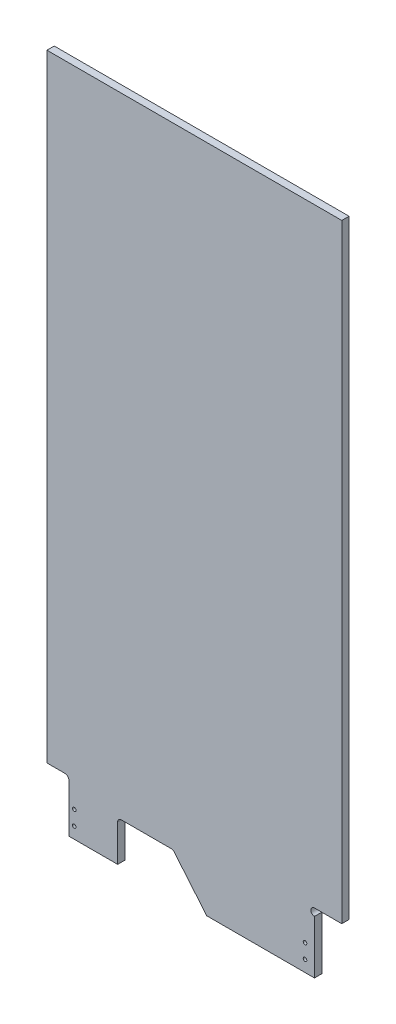
ISO-10303-21;
HEADER;
FILE_DESCRIPTION(('STEP AP214'),'2;1');
FILE_NAME('part.step','',(''),(''),'','','');
FILE_SCHEMA(('AUTOMOTIVE_DESIGN { 1 0 10303 214 1 1 1 1 }'));
ENDSEC;
DATA;
#1=APPLICATION_CONTEXT('core data for automotive mechanical design processes');
#2=APPLICATION_PROTOCOL_DEFINITION('international standard','automotive_design',2000,#1);
#3=PRODUCT_CONTEXT('',#1,'mechanical');
#4=PRODUCT('Part','Part','',(#3));
#5=PRODUCT_RELATED_PRODUCT_CATEGORY('part','',(#4));
#6=PRODUCT_DEFINITION_FORMATION('','',#4);
#7=PRODUCT_DEFINITION_CONTEXT('part definition',#1,'design');
#8=PRODUCT_DEFINITION('design','',#6,#7);
#9=PRODUCT_DEFINITION_SHAPE('','',#8);
#10=(LENGTH_UNIT() NAMED_UNIT(*) SI_UNIT(.MILLI.,.METRE.));
#11=(NAMED_UNIT(*) PLANE_ANGLE_UNIT() SI_UNIT($,.RADIAN.));
#12=(NAMED_UNIT(*) SI_UNIT($,.STERADIAN.) SOLID_ANGLE_UNIT());
#13=UNCERTAINTY_MEASURE_WITH_UNIT(LENGTH_MEASURE(1.E-05),#10,'distance_accuracy_value','');
#14=(GEOMETRIC_REPRESENTATION_CONTEXT(3) GLOBAL_UNCERTAINTY_ASSIGNED_CONTEXT((#13)) GLOBAL_UNIT_ASSIGNED_CONTEXT((#10,
#11,#12)) REPRESENTATION_CONTEXT('',''));
#15=CARTESIAN_POINT('',(0.,0.,0.));
#16=DIRECTION('',(0.,0.,1.));
#17=DIRECTION('',(1.,0.,0.));
#18=AXIS2_PLACEMENT_3D('',#15,#16,#17);
#19=CARTESIAN_POINT('',(10375.9021420887,13102.653009206,-12.7));
#20=DIRECTION('',(-1.,0.,0.));
#21=DIRECTION('',(0.,0.,1.));
#22=AXIS2_PLACEMENT_3D('',#19,#20,#21);
#23=PLANE('',#22);
#24=DIRECTION('',(0.,-1.,0.));
#25=VECTOR('',#24,1.);
#26=CARTESIAN_POINT('',(10375.9021420887,13102.653009206,0.));
#27=LINE('',#26,#25);
#28=CARTESIAN_POINT('',(10375.9021420887,13102.653009206,0.));
#29=VERTEX_POINT('',#28);
#30=CARTESIAN_POINT('',(10375.9021420887,13017.5001101928,0.));
#31=VERTEX_POINT('',#30);
#32=EDGE_CURVE('E176',#29,#31,#27,.T.);
#33=ORIENTED_EDGE('',*,*,#32,.F.);
#34=DIRECTION('',(0.,0.,1.));
#35=VECTOR('',#34,1.);
#36=CARTESIAN_POINT('',(10375.9021420887,13102.653009206,-12.7));
#37=LINE('',#36,#35);
#38=CARTESIAN_POINT('',(10375.9021420887,13102.653009206,-12.7));
#39=VERTEX_POINT('',#38);
#40=EDGE_CURVE('E11',#39,#29,#37,.T.);
#41=ORIENTED_EDGE('',*,*,#40,.F.);
#42=DIRECTION('',(0.,-1.,0.));
#43=VECTOR('',#42,1.);
#44=CARTESIAN_POINT('',(10375.9021420887,13102.653009206,-12.7));
#45=LINE('',#44,#43);
#46=CARTESIAN_POINT('',(10375.9021420887,13017.5001101928,-12.7));
#47=VERTEX_POINT('',#46);
#48=EDGE_CURVE('E221',#39,#47,#45,.T.);
#49=ORIENTED_EDGE('',*,*,#48,.T.);
#50=DIRECTION('',(0.,0.,1.));
#51=VECTOR('',#50,1.);
#52=CARTESIAN_POINT('',(10375.9021420887,13017.5001101928,-12.7));
#53=LINE('',#52,#51);
#54=EDGE_CURVE('E34',#47,#31,#53,.T.);
#55=ORIENTED_EDGE('',*,*,#54,.T.);
#56=EDGE_LOOP('',(#33,#41,#49,#55));
#57=FACE_BOUND('',#56,.T.);
#58=ADVANCED_FACE('F31',(#57),#23,.T.);
#59=CARTESIAN_POINT('',(10369.5521420887,13102.653009206,-12.7));
#60=DIRECTION('',(0.,0.,1.));
#61=DIRECTION('',(1.,0.,0.));
#62=AXIS2_PLACEMENT_3D('',#59,#60,#61);
#63=CYLINDRICAL_SURFACE('',#62,6.34999999999941);
#64=CARTESIAN_POINT('',(10369.5521420887,13102.653009206,0.));
#65=DIRECTION('',(0.,0.,-1.));
#66=DIRECTION('',(-1.,0.,0.));
#67=AXIS2_PLACEMENT_3D('',#64,#65,#66);
#68=CIRCLE('',#67,6.34999999999941);
#69=CARTESIAN_POINT('',(10369.5521420887,13109.003009206,0.));
#70=VERTEX_POINT('',#69);
#71=EDGE_CURVE('E219',#70,#29,#68,.T.);
#72=ORIENTED_EDGE('',*,*,#71,.F.);
#73=DIRECTION('',(0.,0.,1.));
#74=VECTOR('',#73,1.);
#75=CARTESIAN_POINT('',(10369.5521420887,13109.003009206,-12.7));
#76=LINE('',#75,#74);
#77=CARTESIAN_POINT('',(10369.5521420887,13109.003009206,-12.7));
#78=VERTEX_POINT('',#77);
#79=EDGE_CURVE('E40',#78,#70,#76,.T.);
#80=ORIENTED_EDGE('',*,*,#79,.F.);
#81=CARTESIAN_POINT('',(10369.5521420887,13102.653009206,-12.7));
#82=DIRECTION('',(0.,0.,-1.));
#83=DIRECTION('',(-1.,0.,0.));
#84=AXIS2_PLACEMENT_3D('',#81,#82,#83);
#85=CIRCLE('',#84,6.34999999999941);
#86=EDGE_CURVE('E166',#78,#39,#85,.T.);
#87=ORIENTED_EDGE('',*,*,#86,.T.);
#88=ORIENTED_EDGE('',*,*,#40,.T.);
#89=EDGE_LOOP('',(#72,#80,#87,#88));
#90=FACE_BOUND('',#89,.T.);
#91=ADVANCED_FACE('F249',(#90),#63,.F.);
#92=CARTESIAN_POINT('',(10337.8021420887,13109.003009206,-12.7));
#93=DIRECTION('',(0.,-1.,0.));
#94=DIRECTION('',(0.,0.,-1.));
#95=AXIS2_PLACEMENT_3D('',#92,#93,#94);
#96=PLANE('',#95);
#97=DIRECTION('',(1.,0.,0.));
#98=VECTOR('',#97,1.);
#99=CARTESIAN_POINT('',(10337.8021420887,13109.003009206,0.));
#100=LINE('',#99,#98);
#101=CARTESIAN_POINT('',(10337.8021420887,13109.003009206,0.));
#102=VERTEX_POINT('',#101);
#103=EDGE_CURVE('E153',#102,#70,#100,.T.);
#104=ORIENTED_EDGE('',*,*,#103,.F.);
#105=DIRECTION('',(0.,0.,1.));
#106=VECTOR('',#105,1.);
#107=CARTESIAN_POINT('',(10337.8021420887,13109.003009206,-12.7));
#108=LINE('',#107,#106);
#109=CARTESIAN_POINT('',(10337.8021420887,13109.003009206,-12.7));
#110=VERTEX_POINT('',#109);
#111=EDGE_CURVE('E148',#110,#102,#108,.T.);
#112=ORIENTED_EDGE('',*,*,#111,.F.);
#113=DIRECTION('',(1.,0.,0.));
#114=VECTOR('',#113,1.);
#115=CARTESIAN_POINT('',(10337.8021420887,13109.003009206,-12.7));
#116=LINE('',#115,#114);
#117=EDGE_CURVE('E151',#110,#78,#116,.T.);
#118=ORIENTED_EDGE('',*,*,#117,.T.);
#119=ORIENTED_EDGE('',*,*,#79,.T.);
#120=EDGE_LOOP('',(#104,#112,#118,#119));
#121=FACE_BOUND('',#120,.T.);
#122=ADVANCED_FACE('F150',(#121),#96,.T.);
#123=CARTESIAN_POINT('',(10337.8007478141,14185.9001101928,-12.7));
#124=DIRECTION('',(-0.999999999999162,-1.29471476797222E-06,0.));
#125=DIRECTION('',(1.29471476797222E-06,-0.999999999999162,0.));
#126=AXIS2_PLACEMENT_3D('',#123,#124,#125);
#127=PLANE('',#126);
#128=DIRECTION('',(1.29471476797222E-06,-0.999999999999162,0.));
#129=VECTOR('',#128,1.);
#130=CARTESIAN_POINT('',(10337.8007478141,14185.9001101928,0.));
#131=LINE('',#130,#129);
#132=CARTESIAN_POINT('',(10337.8007478141,14185.9001101928,0.));
#133=VERTEX_POINT('',#132);
#134=EDGE_CURVE('E216',#133,#102,#131,.T.);
#135=ORIENTED_EDGE('',*,*,#134,.F.);
#136=DIRECTION('',(0.,0.,1.));
#137=VECTOR('',#136,1.);
#138=CARTESIAN_POINT('',(10337.8007478141,14185.9001101928,-12.7));
#139=LINE('',#138,#137);
#140=CARTESIAN_POINT('',(10337.8007478141,14185.9001101928,-12.7));
#141=VERTEX_POINT('',#140);
#142=EDGE_CURVE('E158',#141,#133,#139,.T.);
#143=ORIENTED_EDGE('',*,*,#142,.F.);
#144=DIRECTION('',(1.29471476797222E-06,-0.999999999999162,0.));
#145=VECTOR('',#144,1.);
#146=CARTESIAN_POINT('',(10337.8007478141,14185.9001101928,-12.7));
#147=LINE('',#146,#145);
#148=EDGE_CURVE('E164',#141,#110,#147,.T.);
#149=ORIENTED_EDGE('',*,*,#148,.T.);
#150=ORIENTED_EDGE('',*,*,#111,.T.);
#151=EDGE_LOOP('',(#135,#143,#149,#150));
#152=FACE_BOUND('',#151,.T.);
#153=ADVANCED_FACE('F168',(#152),#127,.T.);
#154=CARTESIAN_POINT('',(10852.1479242815,14185.9001101928,-12.7));
#155=DIRECTION('',(0.,1.,0.));
#156=DIRECTION('',(0.,0.,1.));
#157=AXIS2_PLACEMENT_3D('',#154,#155,#156);
#158=PLANE('',#157);
#159=DIRECTION('',(-1.,0.,0.));
#160=VECTOR('',#159,1.);
#161=CARTESIAN_POINT('',(10852.1479242815,14185.9001101928,0.));
#162=LINE('',#161,#160);
#163=CARTESIAN_POINT('',(10852.1479242815,14185.9001101928,0.));
#164=VERTEX_POINT('',#163);
#165=EDGE_CURVE('E213',#164,#133,#162,.T.);
#166=ORIENTED_EDGE('',*,*,#165,.F.);
#167=DIRECTION('',(0.,0.,1.));
#168=VECTOR('',#167,1.);
#169=CARTESIAN_POINT('',(10852.1479242815,14185.9001101928,-12.7));
#170=LINE('',#169,#168);
#171=CARTESIAN_POINT('',(10852.1479242815,14185.9001101928,-12.7));
#172=VERTEX_POINT('',#171);
#173=EDGE_CURVE('E225',#172,#164,#170,.T.);
#174=ORIENTED_EDGE('',*,*,#173,.F.);
#175=DIRECTION('',(-1.,0.,0.));
#176=VECTOR('',#175,1.);
#177=CARTESIAN_POINT('',(10852.1479242815,14185.9001101928,-12.7));
#178=LINE('',#177,#176);
#179=EDGE_CURVE('E169',#172,#141,#178,.T.);
#180=ORIENTED_EDGE('',*,*,#179,.T.);
#181=ORIENTED_EDGE('',*,*,#142,.T.);
#182=EDGE_LOOP('',(#166,#174,#180,#181));
#183=FACE_BOUND('',#182,.T.);
#184=ADVANCED_FACE('F262',(#183),#158,.T.);
#185=CARTESIAN_POINT('',(10852.1507478141,13123.290509206,-12.7));
#186=DIRECTION('',(0.99999999999647,2.65716833036978E-06,0.));
#187=DIRECTION('',(-2.65716833036978E-06,0.99999999999647,0.));
#188=AXIS2_PLACEMENT_3D('',#185,#186,#187);
#189=PLANE('',#188);
#190=DIRECTION('',(-2.65716833036978E-06,0.99999999999647,0.));
#191=VECTOR('',#190,1.);
#192=CARTESIAN_POINT('',(10852.1507478141,13123.290509206,0.));
#193=LINE('',#192,#191);
#194=CARTESIAN_POINT('',(10852.1507478141,13123.290509206,0.));
#195=VERTEX_POINT('',#194);
#196=EDGE_CURVE('E210',#195,#164,#193,.T.);
#197=ORIENTED_EDGE('',*,*,#196,.F.);
#198=DIRECTION('',(0.,0.,1.));
#199=VECTOR('',#198,1.);
#200=CARTESIAN_POINT('',(10852.1507478141,13123.290509206,-12.7));
#201=LINE('',#200,#199);
#202=CARTESIAN_POINT('',(10852.1507478141,13123.290509206,-12.7));
#203=VERTEX_POINT('',#202);
#204=EDGE_CURVE('E227',#203,#195,#201,.T.);
#205=ORIENTED_EDGE('',*,*,#204,.F.);
#206=DIRECTION('',(-2.65716833036978E-06,0.99999999999647,0.));
#207=VECTOR('',#206,1.);
#208=CARTESIAN_POINT('',(10852.1507478141,13123.290509206,-12.7));
#209=LINE('',#208,#207);
#210=EDGE_CURVE('E171',#203,#172,#209,.T.);
#211=ORIENTED_EDGE('',*,*,#210,.T.);
#212=ORIENTED_EDGE('',*,*,#173,.T.);
#213=EDGE_LOOP('',(#197,#205,#211,#212));
#214=FACE_BOUND('',#213,.T.);
#215=ADVANCED_FACE('F265',(#214),#189,.T.);
#216=CARTESIAN_POINT('',(10804.5257478141,13123.290509206,-12.7));
#217=DIRECTION('',(0.,-1.,0.));
#218=DIRECTION('',(0.,0.,-1.));
#219=AXIS2_PLACEMENT_3D('',#216,#217,#218);
#220=PLANE('',#219);
#221=DIRECTION('',(1.,0.,0.));
#222=VECTOR('',#221,1.);
#223=CARTESIAN_POINT('',(10804.5257478141,13123.290509206,0.));
#224=LINE('',#223,#222);
#225=CARTESIAN_POINT('',(10804.5257478141,13123.290509206,0.));
#226=VERTEX_POINT('',#225);
#227=EDGE_CURVE('E207',#226,#195,#224,.T.);
#228=ORIENTED_EDGE('',*,*,#227,.F.);
#229=DIRECTION('',(0.,0.,1.));
#230=VECTOR('',#229,1.);
#231=CARTESIAN_POINT('',(10804.5257478141,13123.290509206,-12.7));
#232=LINE('',#231,#230);
#233=CARTESIAN_POINT('',(10804.5257478141,13123.290509206,-12.7));
#234=VERTEX_POINT('',#233);
#235=EDGE_CURVE('E229',#234,#226,#232,.T.);
#236=ORIENTED_EDGE('',*,*,#235,.F.);
#237=DIRECTION('',(1.,0.,0.));
#238=VECTOR('',#237,1.);
#239=CARTESIAN_POINT('',(10804.5257478141,13123.290509206,-12.7));
#240=LINE('',#239,#238);
#241=EDGE_CURVE('E387',#234,#203,#240,.T.);
#242=ORIENTED_EDGE('',*,*,#241,.T.);
#243=ORIENTED_EDGE('',*,*,#204,.T.);
#244=EDGE_LOOP('',(#228,#236,#242,#243));
#245=FACE_BOUND('',#244,.T.);
#246=ADVANCED_FACE('F269',(#245),#220,.T.);
#247=CARTESIAN_POINT('',(10804.5257478141,13116.940509206,-12.7));
#248=DIRECTION('',(0.,0.,1.));
#249=DIRECTION('',(1.,0.,0.));
#250=AXIS2_PLACEMENT_3D('',#247,#248,#249);
#251=CYLINDRICAL_SURFACE('',#250,6.34999999999941);
#252=CARTESIAN_POINT('',(10804.5257478141,13116.940509206,0.));
#253=DIRECTION('',(0.,0.,-1.));
#254=DIRECTION('',(1.,0.,0.));
#255=AXIS2_PLACEMENT_3D('',#252,#253,#254);
#256=CIRCLE('',#255,6.34999999999941);
#257=CARTESIAN_POINT('',(10804.5257478141,13110.590509206,0.));
#258=VERTEX_POINT('',#257);
#259=EDGE_CURVE('E204',#258,#226,#256,.T.);
#260=ORIENTED_EDGE('',*,*,#259,.F.);
#261=DIRECTION('',(0.,0.,1.));
#262=VECTOR('',#261,1.);
#263=CARTESIAN_POINT('',(10804.5257478141,13110.590509206,-12.7));
#264=LINE('',#263,#262);
#265=CARTESIAN_POINT('',(10804.5257478141,13110.590509206,-12.7));
#266=VERTEX_POINT('',#265);
#267=EDGE_CURVE('E231',#266,#258,#264,.T.);
#268=ORIENTED_EDGE('',*,*,#267,.F.);
#269=CARTESIAN_POINT('',(10804.5257478141,13116.940509206,-12.7));
#270=DIRECTION('',(0.,0.,-1.));
#271=DIRECTION('',(1.,0.,0.));
#272=AXIS2_PLACEMENT_3D('',#269,#270,#271);
#273=CIRCLE('',#272,6.34999999999941);
#274=EDGE_CURVE('E384',#266,#234,#273,.T.);
#275=ORIENTED_EDGE('',*,*,#274,.T.);
#276=ORIENTED_EDGE('',*,*,#235,.T.);
#277=EDGE_LOOP('',(#260,#268,#275,#276));
#278=FACE_BOUND('',#277,.T.);
#279=ADVANCED_FACE('F273',(#278),#251,.F.);
#280=CARTESIAN_POINT('',(10804.5257478141,13017.5001101928,-12.7));
#281=DIRECTION('',(1.,0.,0.));
#282=DIRECTION('',(0.,0.,-1.));
#283=AXIS2_PLACEMENT_3D('',#280,#281,#282);
#284=PLANE('',#283);
#285=DIRECTION('',(0.,1.,0.));
#286=VECTOR('',#285,1.);
#287=CARTESIAN_POINT('',(10804.5257478141,13017.5001101928,0.));
#288=LINE('',#287,#286);
#289=CARTESIAN_POINT('',(10804.5257478141,13017.5001101928,0.));
#290=VERTEX_POINT('',#289);
#291=EDGE_CURVE('E201',#290,#258,#288,.T.);
#292=ORIENTED_EDGE('',*,*,#291,.F.);
#293=DIRECTION('',(0.,0.,1.));
#294=VECTOR('',#293,1.);
#295=CARTESIAN_POINT('',(10804.5257478141,13017.5001101928,-12.7));
#296=LINE('',#295,#294);
#297=CARTESIAN_POINT('',(10804.5257478141,13017.5001101928,-12.7));
#298=VERTEX_POINT('',#297);
#299=EDGE_CURVE('E233',#298,#290,#296,.T.);
#300=ORIENTED_EDGE('',*,*,#299,.F.);
#301=DIRECTION('',(0.,1.,0.));
#302=VECTOR('',#301,1.);
#303=CARTESIAN_POINT('',(10804.5257478141,13017.5001101928,-12.7));
#304=LINE('',#303,#302);
#305=EDGE_CURVE('E381',#298,#266,#304,.T.);
#306=ORIENTED_EDGE('',*,*,#305,.T.);
#307=ORIENTED_EDGE('',*,*,#267,.T.);
#308=EDGE_LOOP('',(#292,#300,#306,#307));
#309=FACE_BOUND('',#308,.T.);
#310=ADVANCED_FACE('F277',(#309),#284,.T.);
#311=CARTESIAN_POINT('',(10616.6252235168,13017.5001101928,-12.7));
#312=DIRECTION('',(0.,-1.,0.));
#313=DIRECTION('',(0.,0.,-1.));
#314=AXIS2_PLACEMENT_3D('',#311,#312,#313);
#315=PLANE('',#314);
#316=DIRECTION('',(1.,0.,0.));
#317=VECTOR('',#316,1.);
#318=CARTESIAN_POINT('',(10616.6252235168,13017.5001101928,0.));
#319=LINE('',#318,#317);
#320=CARTESIAN_POINT('',(10616.6252235168,13017.5001101928,0.));
#321=VERTEX_POINT('',#320);
#322=EDGE_CURVE('E198',#321,#290,#319,.T.);
#323=ORIENTED_EDGE('',*,*,#322,.F.);
#324=DIRECTION('',(0.,0.,1.));
#325=VECTOR('',#324,1.);
#326=CARTESIAN_POINT('',(10616.6252235168,13017.5001101928,-12.7));
#327=LINE('',#326,#325);
#328=CARTESIAN_POINT('',(10616.6252235168,13017.5001101928,-12.7));
#329=VERTEX_POINT('',#328);
#330=EDGE_CURVE('E235',#329,#321,#327,.T.);
#331=ORIENTED_EDGE('',*,*,#330,.F.);
#332=DIRECTION('',(1.,0.,0.));
#333=VECTOR('',#332,1.);
#334=CARTESIAN_POINT('',(10616.6252235168,13017.5001101928,-12.7));
#335=LINE('',#334,#333);
#336=EDGE_CURVE('E378',#329,#298,#335,.T.);
#337=ORIENTED_EDGE('',*,*,#336,.T.);
#338=ORIENTED_EDGE('',*,*,#299,.T.);
#339=EDGE_LOOP('',(#323,#331,#337,#338));
#340=FACE_BOUND('',#339,.T.);
#341=ADVANCED_FACE('F281',(#340),#315,.T.);
#342=CARTESIAN_POINT('',(10559.6498937161,13085.6670433405,-12.7));
#343=DIRECTION('',(-0.767281863842619,-0.641310019739437,0.));
#344=DIRECTION('',(0.641310019739437,-0.767281863842619,0.));
#345=AXIS2_PLACEMENT_3D('',#342,#343,#344);
#346=PLANE('',#345);
#347=DIRECTION('',(0.641310019739437,-0.767281863842619,0.));
#348=VECTOR('',#347,1.);
#349=CARTESIAN_POINT('',(10559.6498937161,13085.6670433405,0.));
#350=LINE('',#349,#348);
#351=CARTESIAN_POINT('',(10559.6498937161,13085.6670433405,0.));
#352=VERTEX_POINT('',#351);
#353=EDGE_CURVE('E195',#352,#321,#350,.T.);
#354=ORIENTED_EDGE('',*,*,#353,.F.);
#355=DIRECTION('',(0.,0.,1.));
#356=VECTOR('',#355,1.);
#357=CARTESIAN_POINT('',(10559.6498937161,13085.6670433405,-12.7));
#358=LINE('',#357,#356);
#359=CARTESIAN_POINT('',(10559.6498937161,13085.6670433405,-12.7));
#360=VERTEX_POINT('',#359);
#361=EDGE_CURVE('E237',#360,#352,#358,.T.);
#362=ORIENTED_EDGE('',*,*,#361,.F.);
#363=DIRECTION('',(0.641310019739437,-0.767281863842619,0.));
#364=VECTOR('',#363,1.);
#365=CARTESIAN_POINT('',(10559.6498937161,13085.6670433405,-12.7));
#366=LINE('',#365,#364);
#367=EDGE_CURVE('E375',#360,#329,#366,.T.);
#368=ORIENTED_EDGE('',*,*,#367,.T.);
#369=ORIENTED_EDGE('',*,*,#330,.T.);
#370=EDGE_LOOP('',(#354,#362,#368,#369));
#371=FACE_BOUND('',#370,.T.);
#372=ADVANCED_FACE('F285',(#371),#346,.T.);
#373=CARTESIAN_POINT('',(10554.7776538797,13081.5947247155,-12.7));
#374=DIRECTION('',(0.,0.,1.));
#375=DIRECTION('',(1.,0.,0.));
#376=AXIS2_PLACEMENT_3D('',#373,#374,#375);
#377=CYLINDRICAL_SURFACE('',#376,6.3500000005553);
#378=CARTESIAN_POINT('',(10554.7776538797,13081.5947247155,0.));
#379=DIRECTION('',(0.,0.,-1.));
#380=DIRECTION('',(-1.,0.,0.));
#381=AXIS2_PLACEMENT_3D('',#378,#379,#380);
#382=CIRCLE('',#381,6.3500000005553);
#383=CARTESIAN_POINT('',(10554.7776538797,13087.9447247161,0.));
#384=VERTEX_POINT('',#383);
#385=EDGE_CURVE('E192',#384,#352,#382,.T.);
#386=ORIENTED_EDGE('',*,*,#385,.F.);
#387=DIRECTION('',(0.,0.,1.));
#388=VECTOR('',#387,1.);
#389=CARTESIAN_POINT('',(10554.7776538797,13087.9447247161,-12.7));
#390=LINE('',#389,#388);
#391=CARTESIAN_POINT('',(10554.7776538797,13087.9447247161,-12.7));
#392=VERTEX_POINT('',#391);
#393=EDGE_CURVE('E239',#392,#384,#390,.T.);
#394=ORIENTED_EDGE('',*,*,#393,.F.);
#395=CARTESIAN_POINT('',(10554.7776538797,13081.5947247155,-12.7));
#396=DIRECTION('',(0.,0.,-1.));
#397=DIRECTION('',(-1.,0.,0.));
#398=AXIS2_PLACEMENT_3D('',#395,#396,#397);
#399=CIRCLE('',#398,6.3500000005553);
#400=EDGE_CURVE('E372',#392,#360,#399,.T.);
#401=ORIENTED_EDGE('',*,*,#400,.T.);
#402=ORIENTED_EDGE('',*,*,#361,.T.);
#403=EDGE_LOOP('',(#386,#394,#401,#402));
#404=FACE_BOUND('',#403,.T.);
#405=ADVANCED_FACE('F289',(#404),#377,.F.);
#406=CARTESIAN_POINT('',(10467.5527820586,13087.9447247161,-12.7));
#407=DIRECTION('',(0.,-1.,0.));
#408=DIRECTION('',(0.,0.,-1.));
#409=AXIS2_PLACEMENT_3D('',#406,#407,#408);
#410=PLANE('',#409);
#411=DIRECTION('',(1.,0.,0.));
#412=VECTOR('',#411,1.);
#413=CARTESIAN_POINT('',(10467.5527820586,13087.9447247161,0.));
#414=LINE('',#413,#412);
#415=CARTESIAN_POINT('',(10467.5527820586,13087.9447247161,0.));
#416=VERTEX_POINT('',#415);
#417=EDGE_CURVE('E189',#416,#384,#414,.T.);
#418=ORIENTED_EDGE('',*,*,#417,.F.);
#419=DIRECTION('',(0.,0.,1.));
#420=VECTOR('',#419,1.);
#421=CARTESIAN_POINT('',(10467.5527820586,13087.9447247161,-12.7));
#422=LINE('',#421,#420);
#423=CARTESIAN_POINT('',(10467.5527820586,13087.9447247161,-12.7));
#424=VERTEX_POINT('',#423);
#425=EDGE_CURVE('E241',#424,#416,#422,.T.);
#426=ORIENTED_EDGE('',*,*,#425,.F.);
#427=DIRECTION('',(1.,0.,0.));
#428=VECTOR('',#427,1.);
#429=CARTESIAN_POINT('',(10467.5527820586,13087.9447247161,-12.7));
#430=LINE('',#429,#428);
#431=EDGE_CURVE('E369',#424,#392,#430,.T.);
#432=ORIENTED_EDGE('',*,*,#431,.T.);
#433=ORIENTED_EDGE('',*,*,#393,.T.);
#434=EDGE_LOOP('',(#418,#426,#432,#433));
#435=FACE_BOUND('',#434,.T.);
#436=ADVANCED_FACE('F293',(#435),#410,.T.);
#437=CARTESIAN_POINT('',(10467.5527820586,13081.5947247161,-12.7));
#438=DIRECTION('',(0.,0.,1.));
#439=DIRECTION('',(1.,0.,0.));
#440=AXIS2_PLACEMENT_3D('',#437,#438,#439);
#441=CYLINDRICAL_SURFACE('',#440,6.34999999999941);
#442=CARTESIAN_POINT('',(10467.5527820586,13081.5947247161,0.));
#443=DIRECTION('',(0.,0.,-1.));
#444=DIRECTION('',(-1.,0.,0.));
#445=AXIS2_PLACEMENT_3D('',#442,#443,#444);
#446=CIRCLE('',#445,6.34999999999941);
#447=CARTESIAN_POINT('',(10461.2027820586,13081.5947247161,0.));
#448=VERTEX_POINT('',#447);
#449=EDGE_CURVE('E186',#448,#416,#446,.T.);
#450=ORIENTED_EDGE('',*,*,#449,.F.);
#451=DIRECTION('',(0.,0.,1.));
#452=VECTOR('',#451,1.);
#453=CARTESIAN_POINT('',(10461.2027820586,13081.5947247161,-12.7));
#454=LINE('',#453,#452);
#455=CARTESIAN_POINT('',(10461.2027820586,13081.5947247161,-12.7));
#456=VERTEX_POINT('',#455);
#457=EDGE_CURVE('E243',#456,#448,#454,.T.);
#458=ORIENTED_EDGE('',*,*,#457,.F.);
#459=CARTESIAN_POINT('',(10467.5527820586,13081.5947247161,-12.7));
#460=DIRECTION('',(0.,0.,-1.));
#461=DIRECTION('',(-1.,0.,0.));
#462=AXIS2_PLACEMENT_3D('',#459,#460,#461);
#463=CIRCLE('',#462,6.34999999999941);
#464=EDGE_CURVE('E366',#456,#424,#463,.T.);
#465=ORIENTED_EDGE('',*,*,#464,.T.);
#466=ORIENTED_EDGE('',*,*,#425,.T.);
#467=EDGE_LOOP('',(#450,#458,#465,#466));
#468=FACE_BOUND('',#467,.T.);
#469=ADVANCED_FACE('F297',(#468),#441,.F.);
#470=CARTESIAN_POINT('',(10461.2027820586,13017.5001101928,-12.7));
#471=DIRECTION('',(1.,0.,0.));
#472=DIRECTION('',(0.,0.,-1.));
#473=AXIS2_PLACEMENT_3D('',#470,#471,#472);
#474=PLANE('',#473);
#475=DIRECTION('',(0.,1.,0.));
#476=VECTOR('',#475,1.);
#477=CARTESIAN_POINT('',(10461.2027820586,13017.5001101928,0.));
#478=LINE('',#477,#476);
#479=CARTESIAN_POINT('',(10461.2027820586,13017.5001101928,0.));
#480=VERTEX_POINT('',#479);
#481=EDGE_CURVE('E183',#480,#448,#478,.T.);
#482=ORIENTED_EDGE('',*,*,#481,.F.);
#483=DIRECTION('',(0.,0.,1.));
#484=VECTOR('',#483,1.);
#485=CARTESIAN_POINT('',(10461.2027820586,13017.5001101928,-12.7));
#486=LINE('',#485,#484);
#487=CARTESIAN_POINT('',(10461.2027820586,13017.5001101928,-12.7));
#488=VERTEX_POINT('',#487);
#489=EDGE_CURVE('E244',#488,#480,#486,.T.);
#490=ORIENTED_EDGE('',*,*,#489,.F.);
#491=DIRECTION('',(0.,1.,0.));
#492=VECTOR('',#491,1.);
#493=CARTESIAN_POINT('',(10461.2027820586,13017.5001101928,-12.7));
#494=LINE('',#493,#492);
#495=EDGE_CURVE('E363',#488,#456,#494,.T.);
#496=ORIENTED_EDGE('',*,*,#495,.T.);
#497=ORIENTED_EDGE('',*,*,#457,.T.);
#498=EDGE_LOOP('',(#482,#490,#496,#497));
#499=FACE_BOUND('',#498,.T.);
#500=ADVANCED_FACE('F301',(#499),#474,.T.);
#501=CARTESIAN_POINT('',(10375.9021420887,13017.5001101928,-12.7));
#502=DIRECTION('',(0.,-1.,0.));
#503=DIRECTION('',(0.,0.,-1.));
#504=AXIS2_PLACEMENT_3D('',#501,#502,#503);
#505=PLANE('',#504);
#506=DIRECTION('',(1.,0.,0.));
#507=VECTOR('',#506,1.);
#508=CARTESIAN_POINT('',(10375.9021420887,13017.5001101928,0.));
#509=LINE('',#508,#507);
#510=EDGE_CURVE('E179',#31,#480,#509,.T.);
#511=ORIENTED_EDGE('',*,*,#510,.F.);
#512=ORIENTED_EDGE('',*,*,#54,.F.);
#513=DIRECTION('',(1.,0.,0.));
#514=VECTOR('',#513,1.);
#515=CARTESIAN_POINT('',(10375.9021420887,13017.5001101928,-12.7));
#516=LINE('',#515,#514);
#517=EDGE_CURVE('E361',#47,#488,#516,.T.);
#518=ORIENTED_EDGE('',*,*,#517,.T.);
#519=ORIENTED_EDGE('',*,*,#489,.T.);
#520=EDGE_LOOP('',(#511,#512,#518,#519));
#521=FACE_BOUND('',#520,.T.);
#522=ADVANCED_FACE('F246',(#521),#505,.T.);
#523=CARTESIAN_POINT('',(10467.5527820586,13081.5947247161,-12.7));
#524=DIRECTION('',(0.,0.,-1.));
#525=DIRECTION('',(-1.,0.,0.));
#526=AXIS2_PLACEMENT_3D('',#523,#524,#525);
#527=PLANE('',#526);
#528=CARTESIAN_POINT('',(10788.0150506781,13037.3121101928,-12.7));
#529=DIRECTION('',(0.,0.,-1.));
#530=DIRECTION('',(-1.,0.,0.));
#531=AXIS2_PLACEMENT_3D('',#528,#529,#530);
#532=CIRCLE('',#531,3.11149999999886);
#533=CARTESIAN_POINT('',(10784.9035506781,13037.3121101928,-12.7));
#534=VERTEX_POINT('',#533);
#535=EDGE_CURVE('E339',#534,#534,#532,.F.);
#536=ORIENTED_EDGE('',*,*,#535,.T.);
#537=EDGE_LOOP('',(#536));
#538=FACE_BOUND('',#537,.T.);
#539=CARTESIAN_POINT('',(10788.0150506781,13062.7121101928,-12.7));
#540=DIRECTION('',(0.,0.,-1.));
#541=DIRECTION('',(-1.,0.,0.));
#542=AXIS2_PLACEMENT_3D('',#539,#540,#541);
#543=CIRCLE('',#542,3.11149999999886);
#544=CARTESIAN_POINT('',(10784.9035506781,13062.7121101928,-12.7));
#545=VERTEX_POINT('',#544);
#546=EDGE_CURVE('E343',#545,#545,#543,.F.);
#547=ORIENTED_EDGE('',*,*,#546,.T.);
#548=EDGE_LOOP('',(#547));
#549=FACE_BOUND('',#548,.T.);
#550=CARTESIAN_POINT('',(10385.4250506781,13037.3121101928,-12.7));
#551=DIRECTION('',(0.,0.,-1.));
#552=DIRECTION('',(-1.,0.,0.));
#553=AXIS2_PLACEMENT_3D('',#550,#551,#552);
#554=CIRCLE('',#553,3.11149999999886);
#555=CARTESIAN_POINT('',(10382.3135506781,13037.3121101928,-12.7));
#556=VERTEX_POINT('',#555);
#557=EDGE_CURVE('E352',#556,#556,#554,.F.);
#558=ORIENTED_EDGE('',*,*,#557,.T.);
#559=EDGE_LOOP('',(#558));
#560=FACE_BOUND('',#559,.T.);
#561=CARTESIAN_POINT('',(10385.4250506781,13062.7121101928,-12.7));
#562=DIRECTION('',(0.,0.,-1.));
#563=DIRECTION('',(-1.,0.,0.));
#564=AXIS2_PLACEMENT_3D('',#561,#562,#563);
#565=CIRCLE('',#564,3.11149999999886);
#566=CARTESIAN_POINT('',(10382.3135506781,13062.7121101928,-12.7));
#567=VERTEX_POINT('',#566);
#568=EDGE_CURVE('E180',#567,#567,#565,.F.);
#569=ORIENTED_EDGE('',*,*,#568,.T.);
#570=EDGE_LOOP('',(#569));
#571=FACE_BOUND('',#570,.T.);
#572=ORIENTED_EDGE('',*,*,#48,.F.);
#573=ORIENTED_EDGE('',*,*,#86,.F.);
#574=ORIENTED_EDGE('',*,*,#117,.F.);
#575=ORIENTED_EDGE('',*,*,#148,.F.);
#576=ORIENTED_EDGE('',*,*,#179,.F.);
#577=ORIENTED_EDGE('',*,*,#210,.F.);
#578=ORIENTED_EDGE('',*,*,#241,.F.);
#579=ORIENTED_EDGE('',*,*,#274,.F.);
#580=ORIENTED_EDGE('',*,*,#305,.F.);
#581=ORIENTED_EDGE('',*,*,#336,.F.);
#582=ORIENTED_EDGE('',*,*,#367,.F.);
#583=ORIENTED_EDGE('',*,*,#400,.F.);
#584=ORIENTED_EDGE('',*,*,#431,.F.);
#585=ORIENTED_EDGE('',*,*,#464,.F.);
#586=ORIENTED_EDGE('',*,*,#495,.F.);
#587=ORIENTED_EDGE('',*,*,#517,.F.);
#588=EDGE_LOOP('',(#572,#573,#574,#575,#576,#577,#578,#579,#580,#581,#582,#583,#584,#585,#586,#587));
#589=FACE_BOUND('',#588,.T.);
#590=ADVANCED_FACE('F162',(#538,#549,#560,#571,#589),#527,.T.);
#591=CARTESIAN_POINT('',(10467.5527820586,13081.5947247161,0.));
#592=DIRECTION('',(0.,0.,-1.));
#593=DIRECTION('',(-1.,0.,0.));
#594=AXIS2_PLACEMENT_3D('',#591,#592,#593);
#595=PLANE('',#594);
#596=CARTESIAN_POINT('',(10788.0150506781,13037.3121101928,0.));
#597=DIRECTION('',(0.,0.,1.));
#598=DIRECTION('',(1.,0.,0.));
#599=AXIS2_PLACEMENT_3D('',#596,#597,#598);
#600=CIRCLE('',#599,3.11149999999886);
#601=CARTESIAN_POINT('',(10791.1265506781,13037.3121101928,0.));
#602=VERTEX_POINT('',#601);
#603=EDGE_CURVE('E337',#602,#602,#600,.T.);
#604=ORIENTED_EDGE('',*,*,#603,.F.);
#605=EDGE_LOOP('',(#604));
#606=FACE_BOUND('',#605,.T.);
#607=CARTESIAN_POINT('',(10788.0150506781,13062.7121101928,0.));
#608=DIRECTION('',(0.,0.,1.));
#609=DIRECTION('',(1.,0.,0.));
#610=AXIS2_PLACEMENT_3D('',#607,#608,#609);
#611=CIRCLE('',#610,3.11149999999886);
#612=CARTESIAN_POINT('',(10791.1265506781,13062.7121101928,0.));
#613=VERTEX_POINT('',#612);
#614=EDGE_CURVE('E340',#613,#613,#611,.T.);
#615=ORIENTED_EDGE('',*,*,#614,.F.);
#616=EDGE_LOOP('',(#615));
#617=FACE_BOUND('',#616,.T.);
#618=CARTESIAN_POINT('',(10385.4250506781,13037.3121101928,0.));
#619=DIRECTION('',(0.,0.,1.));
#620=DIRECTION('',(1.,0.,0.));
#621=AXIS2_PLACEMENT_3D('',#618,#619,#620);
#622=CIRCLE('',#621,3.11149999999886);
#623=CARTESIAN_POINT('',(10388.5365506781,13037.3121101928,0.));
#624=VERTEX_POINT('',#623);
#625=EDGE_CURVE('E349',#624,#624,#622,.T.);
#626=ORIENTED_EDGE('',*,*,#625,.F.);
#627=EDGE_LOOP('',(#626));
#628=FACE_BOUND('',#627,.T.);
#629=CARTESIAN_POINT('',(10385.4250506781,13062.7121101928,0.));
#630=DIRECTION('',(0.,0.,1.));
#631=DIRECTION('',(1.,0.,0.));
#632=AXIS2_PLACEMENT_3D('',#629,#630,#631);
#633=CIRCLE('',#632,3.11149999999886);
#634=CARTESIAN_POINT('',(10388.5365506781,13062.7121101928,0.));
#635=VERTEX_POINT('',#634);
#636=EDGE_CURVE('E355',#635,#635,#633,.T.);
#637=ORIENTED_EDGE('',*,*,#636,.F.);
#638=EDGE_LOOP('',(#637));
#639=FACE_BOUND('',#638,.T.);
#640=ORIENTED_EDGE('',*,*,#32,.T.);
#641=ORIENTED_EDGE('',*,*,#510,.T.);
#642=ORIENTED_EDGE('',*,*,#481,.T.);
#643=ORIENTED_EDGE('',*,*,#449,.T.);
#644=ORIENTED_EDGE('',*,*,#417,.T.);
#645=ORIENTED_EDGE('',*,*,#385,.T.);
#646=ORIENTED_EDGE('',*,*,#353,.T.);
#647=ORIENTED_EDGE('',*,*,#322,.T.);
#648=ORIENTED_EDGE('',*,*,#291,.T.);
#649=ORIENTED_EDGE('',*,*,#259,.T.);
#650=ORIENTED_EDGE('',*,*,#227,.T.);
#651=ORIENTED_EDGE('',*,*,#196,.T.);
#652=ORIENTED_EDGE('',*,*,#165,.T.);
#653=ORIENTED_EDGE('',*,*,#134,.T.);
#654=ORIENTED_EDGE('',*,*,#103,.T.);
#655=ORIENTED_EDGE('',*,*,#71,.T.);
#656=EDGE_LOOP('',(#640,#641,#642,#643,#644,#645,#646,#647,#648,#649,#650,#651,#652,#653,#654,#655));
#657=FACE_BOUND('',#656,.T.);
#658=ADVANCED_FACE('F248',(#606,#617,#628,#639,#657),#595,.F.);
#659=CARTESIAN_POINT('',(10385.4250506781,13062.7121101928,-21.5006509986457));
#660=DIRECTION('',(0.,0.,1.));
#661=DIRECTION('',(1.,0.,0.));
#662=AXIS2_PLACEMENT_3D('',#659,#660,#661);
#663=CYLINDRICAL_SURFACE('',#662,3.11149999999886);
#664=ORIENTED_EDGE('',*,*,#636,.T.);
#665=EDGE_LOOP('',(#664));
#666=FACE_BOUND('',#665,.T.);
#667=ORIENTED_EDGE('',*,*,#568,.F.);
#668=EDGE_LOOP('',(#667));
#669=FACE_BOUND('',#668,.T.);
#670=ADVANCED_FACE('F313',(#666,#669),#663,.F.);
#671=CARTESIAN_POINT('',(10385.4250506781,13037.3121101928,-21.5006509986457));
#672=DIRECTION('',(0.,0.,1.));
#673=DIRECTION('',(1.,0.,0.));
#674=AXIS2_PLACEMENT_3D('',#671,#672,#673);
#675=CYLINDRICAL_SURFACE('',#674,3.11149999999886);
#676=ORIENTED_EDGE('',*,*,#625,.T.);
#677=EDGE_LOOP('',(#676));
#678=FACE_BOUND('',#677,.T.);
#679=ORIENTED_EDGE('',*,*,#557,.F.);
#680=EDGE_LOOP('',(#679));
#681=FACE_BOUND('',#680,.T.);
#682=ADVANCED_FACE('F320',(#678,#681),#675,.F.);
#683=CARTESIAN_POINT('',(10788.0150506781,13062.7121101928,-21.5006509986457));
#684=DIRECTION('',(0.,0.,1.));
#685=DIRECTION('',(1.,0.,0.));
#686=AXIS2_PLACEMENT_3D('',#683,#684,#685);
#687=CYLINDRICAL_SURFACE('',#686,3.11149999999886);
#688=ORIENTED_EDGE('',*,*,#614,.T.);
#689=EDGE_LOOP('',(#688));
#690=FACE_BOUND('',#689,.T.);
#691=ORIENTED_EDGE('',*,*,#546,.F.);
#692=EDGE_LOOP('',(#691));
#693=FACE_BOUND('',#692,.T.);
#694=ADVANCED_FACE('F324',(#690,#693),#687,.F.);
#695=CARTESIAN_POINT('',(10788.0150506781,13037.3121101928,-21.5006509986457));
#696=DIRECTION('',(0.,0.,1.));
#697=DIRECTION('',(1.,0.,0.));
#698=AXIS2_PLACEMENT_3D('',#695,#696,#697);
#699=CYLINDRICAL_SURFACE('',#698,3.11149999999886);
#700=ORIENTED_EDGE('',*,*,#603,.T.);
#701=EDGE_LOOP('',(#700));
#702=FACE_BOUND('',#701,.T.);
#703=ORIENTED_EDGE('',*,*,#535,.F.);
#704=EDGE_LOOP('',(#703));
#705=FACE_BOUND('',#704,.T.);
#706=ADVANCED_FACE('F328',(#702,#705),#699,.F.);
#707=CLOSED_SHELL('',(#58,#91,#122,#153,#184,#215,#246,#279,#310,#341,#372,#405,#436,#469,#500,
#522,#590,#658,#670,#682,#694,#706));
#708=MANIFOLD_SOLID_BREP('B2',#707);
#709=ADVANCED_BREP_SHAPE_REPRESENTATION('',(#18,#708),#14);
#710=SHAPE_DEFINITION_REPRESENTATION(#9,#709);
ENDSEC;
END-ISO-10303-21;
